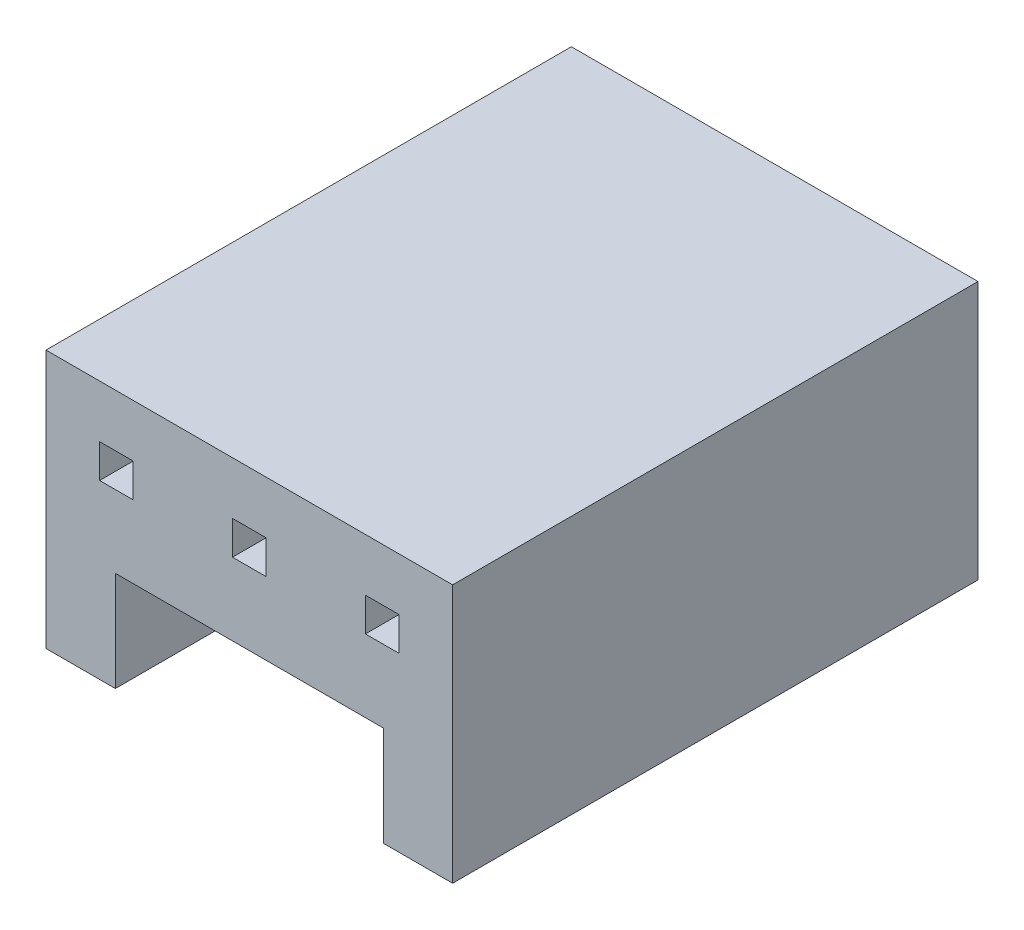
ISO-10303-21;
HEADER;
FILE_DESCRIPTION(('STEP AP214'),'2;1');
FILE_NAME('part.step','',(''),(''),'','','');
FILE_SCHEMA(('AUTOMOTIVE_DESIGN { 1 0 10303 214 1 1 1 1 }'));
ENDSEC;
DATA;
#1=APPLICATION_CONTEXT('core data for automotive mechanical design processes');
#2=APPLICATION_PROTOCOL_DEFINITION('international standard','automotive_design',2000,#1);
#3=PRODUCT_CONTEXT('',#1,'mechanical');
#4=PRODUCT('Part','Part','',(#3));
#5=PRODUCT_RELATED_PRODUCT_CATEGORY('part','',(#4));
#6=PRODUCT_DEFINITION_FORMATION('','',#4);
#7=PRODUCT_DEFINITION_CONTEXT('part definition',#1,'design');
#8=PRODUCT_DEFINITION('design','',#6,#7);
#9=PRODUCT_DEFINITION_SHAPE('','',#8);
#10=(LENGTH_UNIT() NAMED_UNIT(*) SI_UNIT(.MILLI.,.METRE.));
#11=(NAMED_UNIT(*) PLANE_ANGLE_UNIT() SI_UNIT($,.RADIAN.));
#12=(NAMED_UNIT(*) SI_UNIT($,.STERADIAN.) SOLID_ANGLE_UNIT());
#13=UNCERTAINTY_MEASURE_WITH_UNIT(LENGTH_MEASURE(1.E-05),#10,'distance_accuracy_value','');
#14=(GEOMETRIC_REPRESENTATION_CONTEXT(3) GLOBAL_UNCERTAINTY_ASSIGNED_CONTEXT((#13)) GLOBAL_UNIT_ASSIGNED_CONTEXT((#10,
#11,#12)) REPRESENTATION_CONTEXT('',''));
#15=CARTESIAN_POINT('',(0.,0.,0.));
#16=DIRECTION('',(0.,0.,1.));
#17=DIRECTION('',(1.,0.,0.));
#18=AXIS2_PLACEMENT_3D('',#15,#16,#17);
#19=CARTESIAN_POINT('',(0.,0.,-10.));
#20=DIRECTION('',(0.,0.,-1.));
#21=DIRECTION('',(-1.,0.,0.));
#22=AXIS2_PLACEMENT_3D('',#19,#20,#21);
#23=PLANE('',#22);
#24=DIRECTION('',(0.,1.,0.));
#25=VECTOR('',#24,1.);
#26=CARTESIAN_POINT('',(1.66,3.28,-10.));
#27=LINE('',#26,#25);
#28=CARTESIAN_POINT('',(1.66,3.28,-10.));
#29=VERTEX_POINT('',#28);
#30=CARTESIAN_POINT('',(1.66,3.92,-10.));
#31=VERTEX_POINT('',#30);
#32=EDGE_CURVE('E240',#29,#31,#27,.T.);
#33=ORIENTED_EDGE('',*,*,#32,.T.);
#34=DIRECTION('',(-1.,0.,0.));
#35=VECTOR('',#34,1.);
#36=CARTESIAN_POINT('',(1.02,3.92,-10.));
#37=LINE('',#36,#35);
#38=CARTESIAN_POINT('',(1.02,3.92,-10.));
#39=VERTEX_POINT('',#38);
#40=EDGE_CURVE('E244',#31,#39,#37,.T.);
#41=ORIENTED_EDGE('',*,*,#40,.T.);
#42=DIRECTION('',(0.,-1.,0.));
#43=VECTOR('',#42,1.);
#44=CARTESIAN_POINT('',(1.02,3.28,-10.));
#45=LINE('',#44,#43);
#46=CARTESIAN_POINT('',(1.02,3.28,-10.));
#47=VERTEX_POINT('',#46);
#48=EDGE_CURVE('E249',#39,#47,#45,.T.);
#49=ORIENTED_EDGE('',*,*,#48,.T.);
#50=DIRECTION('',(1.,0.,0.));
#51=VECTOR('',#50,1.);
#52=CARTESIAN_POINT('',(1.02,3.28,-10.));
#53=LINE('',#52,#51);
#54=EDGE_CURVE('E253',#47,#29,#53,.T.);
#55=ORIENTED_EDGE('',*,*,#54,.T.);
#56=EDGE_LOOP('',(#33,#41,#49,#55));
#57=FACE_BOUND('',#56,.T.);
#58=DIRECTION('',(0.,1.,0.));
#59=VECTOR('',#58,1.);
#60=CARTESIAN_POINT('',(6.42,0.,-10.));
#61=LINE('',#60,#59);
#62=CARTESIAN_POINT('',(6.42,0.,-10.));
#63=VERTEX_POINT('',#62);
#64=CARTESIAN_POINT('',(6.42,1.9,-10.));
#65=VERTEX_POINT('',#64);
#66=EDGE_CURVE('E312',#63,#65,#61,.T.);
#67=ORIENTED_EDGE('',*,*,#66,.T.);
#68=DIRECTION('',(-1.,0.,0.));
#69=VECTOR('',#68,1.);
#70=CARTESIAN_POINT('',(1.32,1.9,-10.));
#71=LINE('',#70,#69);
#72=CARTESIAN_POINT('',(1.32,1.9,-10.));
#73=VERTEX_POINT('',#72);
#74=EDGE_CURVE('E316',#65,#73,#71,.T.);
#75=ORIENTED_EDGE('',*,*,#74,.T.);
#76=DIRECTION('',(0.,-1.,0.));
#77=VECTOR('',#76,1.);
#78=CARTESIAN_POINT('',(1.32,0.,-10.));
#79=LINE('',#78,#77);
#80=CARTESIAN_POINT('',(1.32,0.,-10.));
#81=VERTEX_POINT('',#80);
#82=EDGE_CURVE('E321',#73,#81,#79,.T.);
#83=ORIENTED_EDGE('',*,*,#82,.T.);
#84=DIRECTION('',(1.,0.,0.));
#85=VECTOR('',#84,1.);
#86=CARTESIAN_POINT('',(0.,0.,-10.));
#87=LINE('',#86,#85);
#88=CARTESIAN_POINT('',(0.,0.,-10.));
#89=VERTEX_POINT('',#88);
#90=EDGE_CURVE('E354',#89,#81,#87,.T.);
#91=ORIENTED_EDGE('',*,*,#90,.F.);
#92=DIRECTION('',(0.,-1.,0.));
#93=VECTOR('',#92,1.);
#94=CARTESIAN_POINT('',(0.,0.,-10.));
#95=LINE('',#94,#93);
#96=CARTESIAN_POINT('',(0.,4.92,-10.));
#97=VERTEX_POINT('',#96);
#98=EDGE_CURVE('E348',#97,#89,#95,.T.);
#99=ORIENTED_EDGE('',*,*,#98,.F.);
#100=DIRECTION('',(-1.,0.,0.));
#101=VECTOR('',#100,1.);
#102=CARTESIAN_POINT('',(0.,4.92,-10.));
#103=LINE('',#102,#101);
#104=CARTESIAN_POINT('',(7.74,4.92,-10.));
#105=VERTEX_POINT('',#104);
#106=EDGE_CURVE('E362',#105,#97,#103,.T.);
#107=ORIENTED_EDGE('',*,*,#106,.F.);
#108=DIRECTION('',(0.,1.,0.));
#109=VECTOR('',#108,1.);
#110=CARTESIAN_POINT('',(7.74,0.,-10.));
#111=LINE('',#110,#109);
#112=CARTESIAN_POINT('',(7.74,0.,-10.));
#113=VERTEX_POINT('',#112);
#114=EDGE_CURVE('E358',#113,#105,#111,.T.);
#115=ORIENTED_EDGE('',*,*,#114,.F.);
#116=EDGE_CURVE('E352',#63,#113,#87,.T.);
#117=ORIENTED_EDGE('',*,*,#116,.F.);
#118=EDGE_LOOP('',(#67,#75,#83,#91,#99,#107,#115,#117));
#119=FACE_BOUND('',#118,.T.);
#120=DIRECTION('',(0.,-1.,0.));
#121=VECTOR('',#120,1.);
#122=CARTESIAN_POINT('',(4.19,3.28,-10.));
#123=LINE('',#122,#121);
#124=CARTESIAN_POINT('',(4.19,3.92,-10.));
#125=VERTEX_POINT('',#124);
#126=CARTESIAN_POINT('',(4.19,3.28,-10.));
#127=VERTEX_POINT('',#126);
#128=EDGE_CURVE('E225',#125,#127,#123,.T.);
#129=ORIENTED_EDGE('',*,*,#128,.F.);
#130=DIRECTION('',(-1.,0.,0.));
#131=VECTOR('',#130,1.);
#132=CARTESIAN_POINT('',(3.55,3.92,-10.));
#133=LINE('',#132,#131);
#134=CARTESIAN_POINT('',(3.55,3.92,-10.));
#135=VERTEX_POINT('',#134);
#136=EDGE_CURVE('E286',#125,#135,#133,.T.);
#137=ORIENTED_EDGE('',*,*,#136,.T.);
#138=DIRECTION('',(0.,-1.,0.));
#139=VECTOR('',#138,1.);
#140=CARTESIAN_POINT('',(3.55,3.28,-10.));
#141=LINE('',#140,#139);
#142=CARTESIAN_POINT('',(3.55,3.28,-10.));
#143=VERTEX_POINT('',#142);
#144=EDGE_CURVE('E290',#135,#143,#141,.T.);
#145=ORIENTED_EDGE('',*,*,#144,.T.);
#146=DIRECTION('',(1.,0.,0.));
#147=VECTOR('',#146,1.);
#148=CARTESIAN_POINT('',(3.55,3.28,-10.));
#149=LINE('',#148,#147);
#150=EDGE_CURVE('E295',#143,#127,#149,.T.);
#151=ORIENTED_EDGE('',*,*,#150,.T.);
#152=EDGE_LOOP('',(#129,#137,#145,#151));
#153=FACE_BOUND('',#152,.T.);
#154=DIRECTION('',(1.,0.,0.));
#155=VECTOR('',#154,1.);
#156=CARTESIAN_POINT('',(6.72,3.92,-10.));
#157=LINE('',#156,#155);
#158=CARTESIAN_POINT('',(6.08,3.92,-10.));
#159=VERTEX_POINT('',#158);
#160=CARTESIAN_POINT('',(6.72,3.92,-10.));
#161=VERTEX_POINT('',#160);
#162=EDGE_CURVE('E192',#159,#161,#157,.T.);
#163=ORIENTED_EDGE('',*,*,#162,.F.);
#164=DIRECTION('',(0.,1.,0.));
#165=VECTOR('',#164,1.);
#166=CARTESIAN_POINT('',(6.08,3.28,-10.));
#167=LINE('',#166,#165);
#168=CARTESIAN_POINT('',(6.08,3.28,-10.));
#169=VERTEX_POINT('',#168);
#170=EDGE_CURVE('E187',#169,#159,#167,.T.);
#171=ORIENTED_EDGE('',*,*,#170,.F.);
#172=DIRECTION('',(-1.,0.,0.));
#173=VECTOR('',#172,1.);
#174=CARTESIAN_POINT('',(6.72,3.28,-10.));
#175=LINE('',#174,#173);
#176=CARTESIAN_POINT('',(6.72,3.28,-10.));
#177=VERTEX_POINT('',#176);
#178=EDGE_CURVE('E178',#177,#169,#175,.T.);
#179=ORIENTED_EDGE('',*,*,#178,.F.);
#180=DIRECTION('',(0.,-1.,0.));
#181=VECTOR('',#180,1.);
#182=CARTESIAN_POINT('',(6.72,3.28,-10.));
#183=LINE('',#182,#181);
#184=EDGE_CURVE('E186',#161,#177,#183,.T.);
#185=ORIENTED_EDGE('',*,*,#184,.F.);
#186=EDGE_LOOP('',(#163,#171,#179,#185));
#187=FACE_BOUND('',#186,.T.);
#188=ADVANCED_FACE('F39',(#57,#119,#153,#187),#23,.T.);
#189=CARTESIAN_POINT('',(0.,0.,0.));
#190=DIRECTION('',(0.,0.,-1.));
#191=DIRECTION('',(-1.,0.,0.));
#192=AXIS2_PLACEMENT_3D('',#189,#190,#191);
#193=PLANE('',#192);
#194=DIRECTION('',(-1.,0.,0.));
#195=VECTOR('',#194,1.);
#196=CARTESIAN_POINT('',(3.55,3.92,0.));
#197=LINE('',#196,#195);
#198=CARTESIAN_POINT('',(4.19,3.92,0.));
#199=VERTEX_POINT('',#198);
#200=CARTESIAN_POINT('',(3.55,3.92,0.));
#201=VERTEX_POINT('',#200);
#202=EDGE_CURVE('E219',#199,#201,#197,.T.);
#203=ORIENTED_EDGE('',*,*,#202,.F.);
#204=DIRECTION('',(0.,-1.,0.));
#205=VECTOR('',#204,1.);
#206=CARTESIAN_POINT('',(4.19,3.28,0.));
#207=LINE('',#206,#205);
#208=CARTESIAN_POINT('',(4.19,3.28,0.));
#209=VERTEX_POINT('',#208);
#210=EDGE_CURVE('E230',#199,#209,#207,.T.);
#211=ORIENTED_EDGE('',*,*,#210,.T.);
#212=DIRECTION('',(1.,0.,0.));
#213=VECTOR('',#212,1.);
#214=CARTESIAN_POINT('',(3.55,3.28,0.));
#215=LINE('',#214,#213);
#216=CARTESIAN_POINT('',(3.55,3.28,0.));
#217=VERTEX_POINT('',#216);
#218=EDGE_CURVE('E291',#217,#209,#215,.T.);
#219=ORIENTED_EDGE('',*,*,#218,.F.);
#220=DIRECTION('',(0.,-1.,0.));
#221=VECTOR('',#220,1.);
#222=CARTESIAN_POINT('',(3.55,3.28,0.));
#223=LINE('',#222,#221);
#224=EDGE_CURVE('E301',#201,#217,#223,.T.);
#225=ORIENTED_EDGE('',*,*,#224,.F.);
#226=EDGE_LOOP('',(#203,#211,#219,#225));
#227=FACE_BOUND('',#226,.T.);
#228=DIRECTION('',(-1.,0.,0.));
#229=VECTOR('',#228,1.);
#230=CARTESIAN_POINT('',(1.02,3.92,0.));
#231=LINE('',#230,#229);
#232=CARTESIAN_POINT('',(1.66,3.92,0.));
#233=VERTEX_POINT('',#232);
#234=CARTESIAN_POINT('',(1.02,3.92,0.));
#235=VERTEX_POINT('',#234);
#236=EDGE_CURVE('E261',#233,#235,#231,.T.);
#237=ORIENTED_EDGE('',*,*,#236,.F.);
#238=DIRECTION('',(0.,1.,0.));
#239=VECTOR('',#238,1.);
#240=CARTESIAN_POINT('',(1.66,3.28,0.));
#241=LINE('',#240,#239);
#242=CARTESIAN_POINT('',(1.66,3.28,0.));
#243=VERTEX_POINT('',#242);
#244=EDGE_CURVE('E258',#243,#233,#241,.T.);
#245=ORIENTED_EDGE('',*,*,#244,.F.);
#246=DIRECTION('',(1.,0.,0.));
#247=VECTOR('',#246,1.);
#248=CARTESIAN_POINT('',(1.02,3.28,0.));
#249=LINE('',#248,#247);
#250=CARTESIAN_POINT('',(1.02,3.28,0.));
#251=VERTEX_POINT('',#250);
#252=EDGE_CURVE('E245',#251,#243,#249,.T.);
#253=ORIENTED_EDGE('',*,*,#252,.F.);
#254=DIRECTION('',(0.,-1.,0.));
#255=VECTOR('',#254,1.);
#256=CARTESIAN_POINT('',(1.02,3.28,0.));
#257=LINE('',#256,#255);
#258=EDGE_CURVE('E266',#235,#251,#257,.T.);
#259=ORIENTED_EDGE('',*,*,#258,.F.);
#260=EDGE_LOOP('',(#237,#245,#253,#259));
#261=FACE_BOUND('',#260,.T.);
#262=DIRECTION('',(-1.,0.,0.));
#263=VECTOR('',#262,1.);
#264=CARTESIAN_POINT('',(1.32,1.9,0.));
#265=LINE('',#264,#263);
#266=CARTESIAN_POINT('',(6.42,1.9,0.));
#267=VERTEX_POINT('',#266);
#268=CARTESIAN_POINT('',(1.32,1.9,0.));
#269=VERTEX_POINT('',#268);
#270=EDGE_CURVE('E328',#267,#269,#265,.T.);
#271=ORIENTED_EDGE('',*,*,#270,.F.);
#272=DIRECTION('',(0.,1.,0.));
#273=VECTOR('',#272,1.);
#274=CARTESIAN_POINT('',(6.42,0.,0.));
#275=LINE('',#274,#273);
#276=CARTESIAN_POINT('',(6.42,0.,0.));
#277=VERTEX_POINT('',#276);
#278=EDGE_CURVE('E276',#277,#267,#275,.T.);
#279=ORIENTED_EDGE('',*,*,#278,.F.);
#280=DIRECTION('',(1.,0.,0.));
#281=VECTOR('',#280,1.);
#282=CARTESIAN_POINT('',(0.,0.,0.));
#283=LINE('',#282,#281);
#284=CARTESIAN_POINT('',(7.74,0.,0.));
#285=VERTEX_POINT('',#284);
#286=EDGE_CURVE('E369',#277,#285,#283,.T.);
#287=ORIENTED_EDGE('',*,*,#286,.T.);
#288=DIRECTION('',(0.,1.,0.));
#289=VECTOR('',#288,1.);
#290=CARTESIAN_POINT('',(7.74,0.,0.));
#291=LINE('',#290,#289);
#292=CARTESIAN_POINT('',(7.74,4.92,0.));
#293=VERTEX_POINT('',#292);
#294=EDGE_CURVE('E374',#285,#293,#291,.T.);
#295=ORIENTED_EDGE('',*,*,#294,.T.);
#296=DIRECTION('',(-1.,0.,0.));
#297=VECTOR('',#296,1.);
#298=CARTESIAN_POINT('',(0.,4.92,0.));
#299=LINE('',#298,#297);
#300=CARTESIAN_POINT('',(0.,4.92,0.));
#301=VERTEX_POINT('',#300);
#302=EDGE_CURVE('E353',#293,#301,#299,.T.);
#303=ORIENTED_EDGE('',*,*,#302,.T.);
#304=DIRECTION('',(0.,-1.,0.));
#305=VECTOR('',#304,1.);
#306=CARTESIAN_POINT('',(0.,0.,0.));
#307=LINE('',#306,#305);
#308=CARTESIAN_POINT('',(0.,0.,0.));
#309=VERTEX_POINT('',#308);
#310=EDGE_CURVE('E337',#301,#309,#307,.T.);
#311=ORIENTED_EDGE('',*,*,#310,.T.);
#312=CARTESIAN_POINT('',(1.32,0.,0.));
#313=VERTEX_POINT('',#312);
#314=EDGE_CURVE('E370',#309,#313,#283,.T.);
#315=ORIENTED_EDGE('',*,*,#314,.T.);
#316=DIRECTION('',(0.,-1.,0.));
#317=VECTOR('',#316,1.);
#318=CARTESIAN_POINT('',(1.32,0.,0.));
#319=LINE('',#318,#317);
#320=EDGE_CURVE('E317',#269,#313,#319,.T.);
#321=ORIENTED_EDGE('',*,*,#320,.F.);
#322=EDGE_LOOP('',(#271,#279,#287,#295,#303,#311,#315,#321));
#323=FACE_BOUND('',#322,.T.);
#324=DIRECTION('',(0.,1.,0.));
#325=VECTOR('',#324,1.);
#326=CARTESIAN_POINT('',(6.08,3.28,0.));
#327=LINE('',#326,#325);
#328=CARTESIAN_POINT('',(6.08,3.28,0.));
#329=VERTEX_POINT('',#328);
#330=CARTESIAN_POINT('',(6.08,3.92,0.));
#331=VERTEX_POINT('',#330);
#332=EDGE_CURVE('E65',#329,#331,#327,.T.);
#333=ORIENTED_EDGE('',*,*,#332,.T.);
#334=DIRECTION('',(1.,0.,0.));
#335=VECTOR('',#334,1.);
#336=CARTESIAN_POINT('',(6.72,3.92,0.));
#337=LINE('',#336,#335);
#338=CARTESIAN_POINT('',(6.72,3.92,0.));
#339=VERTEX_POINT('',#338);
#340=EDGE_CURVE('E196',#331,#339,#337,.T.);
#341=ORIENTED_EDGE('',*,*,#340,.T.);
#342=DIRECTION('',(0.,-1.,0.));
#343=VECTOR('',#342,1.);
#344=CARTESIAN_POINT('',(6.72,3.28,0.));
#345=LINE('',#344,#343);
#346=CARTESIAN_POINT('',(6.72,3.28,0.));
#347=VERTEX_POINT('',#346);
#348=EDGE_CURVE('E200',#339,#347,#345,.T.);
#349=ORIENTED_EDGE('',*,*,#348,.T.);
#350=DIRECTION('',(-1.,0.,0.));
#351=VECTOR('',#350,1.);
#352=CARTESIAN_POINT('',(6.72,3.28,0.));
#353=LINE('',#352,#351);
#354=EDGE_CURVE('E209',#347,#329,#353,.T.);
#355=ORIENTED_EDGE('',*,*,#354,.T.);
#356=EDGE_LOOP('',(#333,#341,#349,#355));
#357=FACE_BOUND('',#356,.T.);
#358=ADVANCED_FACE('F400',(#227,#261,#323,#357),#193,.F.);
#359=CARTESIAN_POINT('',(0.,0.,-10.));
#360=DIRECTION('',(0.,-1.,0.));
#361=DIRECTION('',(0.,0.,-1.));
#362=AXIS2_PLACEMENT_3D('',#359,#360,#361);
#363=PLANE('',#362);
#364=DIRECTION('',(0.,0.,1.));
#365=VECTOR('',#364,1.);
#366=CARTESIAN_POINT('',(6.42,0.,-10.));
#367=LINE('',#366,#365);
#368=EDGE_CURVE('E334',#63,#277,#367,.T.);
#369=ORIENTED_EDGE('',*,*,#368,.F.);
#370=ORIENTED_EDGE('',*,*,#116,.T.);
#371=DIRECTION('',(0.,0.,1.));
#372=VECTOR('',#371,1.);
#373=CARTESIAN_POINT('',(7.74,0.,-10.));
#374=LINE('',#373,#372);
#375=EDGE_CURVE('E382',#113,#285,#374,.T.);
#376=ORIENTED_EDGE('',*,*,#375,.T.);
#377=ORIENTED_EDGE('',*,*,#286,.F.);
#378=EDGE_LOOP('',(#369,#370,#376,#377));
#379=FACE_BOUND('',#378,.T.);
#380=ADVANCED_FACE('F420',(#379),#363,.T.);
#381=CARTESIAN_POINT('',(0.,0.,-10.));
#382=DIRECTION('',(-1.,0.,0.));
#383=DIRECTION('',(0.,0.,1.));
#384=AXIS2_PLACEMENT_3D('',#381,#382,#383);
#385=PLANE('',#384);
#386=ORIENTED_EDGE('',*,*,#310,.F.);
#387=DIRECTION('',(0.,0.,1.));
#388=VECTOR('',#387,1.);
#389=CARTESIAN_POINT('',(0.,4.92,-10.));
#390=LINE('',#389,#388);
#391=EDGE_CURVE('E11',#97,#301,#390,.T.);
#392=ORIENTED_EDGE('',*,*,#391,.F.);
#393=ORIENTED_EDGE('',*,*,#98,.T.);
#394=DIRECTION('',(0.,0.,1.));
#395=VECTOR('',#394,1.);
#396=CARTESIAN_POINT('',(0.,0.,-10.));
#397=LINE('',#396,#395);
#398=EDGE_CURVE('E43',#89,#309,#397,.T.);
#399=ORIENTED_EDGE('',*,*,#398,.T.);
#400=EDGE_LOOP('',(#386,#392,#393,#399));
#401=FACE_BOUND('',#400,.T.);
#402=ADVANCED_FACE('F41',(#401),#385,.T.);
#403=CARTESIAN_POINT('',(0.,4.92,-10.));
#404=DIRECTION('',(0.,1.,0.));
#405=DIRECTION('',(0.,0.,1.));
#406=AXIS2_PLACEMENT_3D('',#403,#404,#405);
#407=PLANE('',#406);
#408=ORIENTED_EDGE('',*,*,#302,.F.);
#409=DIRECTION('',(0.,0.,1.));
#410=VECTOR('',#409,1.);
#411=CARTESIAN_POINT('',(7.74,4.92,-10.));
#412=LINE('',#411,#410);
#413=EDGE_CURVE('E49',#105,#293,#412,.T.);
#414=ORIENTED_EDGE('',*,*,#413,.F.);
#415=ORIENTED_EDGE('',*,*,#106,.T.);
#416=ORIENTED_EDGE('',*,*,#391,.T.);
#417=EDGE_LOOP('',(#408,#414,#415,#416));
#418=FACE_BOUND('',#417,.T.);
#419=ADVANCED_FACE('F404',(#418),#407,.T.);
#420=CARTESIAN_POINT('',(7.74,0.,-10.));
#421=DIRECTION('',(1.,0.,0.));
#422=DIRECTION('',(0.,0.,-1.));
#423=AXIS2_PLACEMENT_3D('',#420,#421,#422);
#424=PLANE('',#423);
#425=ORIENTED_EDGE('',*,*,#294,.F.);
#426=ORIENTED_EDGE('',*,*,#375,.F.);
#427=ORIENTED_EDGE('',*,*,#114,.T.);
#428=ORIENTED_EDGE('',*,*,#413,.T.);
#429=EDGE_LOOP('',(#425,#426,#427,#428));
#430=FACE_BOUND('',#429,.T.);
#431=ADVANCED_FACE('F424',(#430),#424,.T.);
#432=DIRECTION('',(0.,0.,1.));
#433=VECTOR('',#432,1.);
#434=CARTESIAN_POINT('',(1.32,0.,-10.));
#435=LINE('',#434,#433);
#436=EDGE_CURVE('E338',#81,#313,#435,.T.);
#437=ORIENTED_EDGE('',*,*,#436,.T.);
#438=ORIENTED_EDGE('',*,*,#314,.F.);
#439=ORIENTED_EDGE('',*,*,#398,.F.);
#440=ORIENTED_EDGE('',*,*,#90,.T.);
#441=EDGE_LOOP('',(#437,#438,#439,#440));
#442=FACE_BOUND('',#441,.T.);
#443=ADVANCED_FACE('F396',(#442),#363,.T.);
#444=CARTESIAN_POINT('',(6.42,0.,-10.));
#445=DIRECTION('',(1.,0.,0.));
#446=DIRECTION('',(0.,0.,-1.));
#447=AXIS2_PLACEMENT_3D('',#444,#445,#446);
#448=PLANE('',#447);
#449=ORIENTED_EDGE('',*,*,#278,.T.);
#450=DIRECTION('',(0.,0.,1.));
#451=VECTOR('',#450,1.);
#452=CARTESIAN_POINT('',(6.42,1.9,-10.));
#453=LINE('',#452,#451);
#454=EDGE_CURVE('E325',#65,#267,#453,.T.);
#455=ORIENTED_EDGE('',*,*,#454,.F.);
#456=ORIENTED_EDGE('',*,*,#66,.F.);
#457=ORIENTED_EDGE('',*,*,#368,.T.);
#458=EDGE_LOOP('',(#449,#455,#456,#457));
#459=FACE_BOUND('',#458,.T.);
#460=ADVANCED_FACE('F417',(#459),#448,.F.);
#461=CARTESIAN_POINT('',(1.32,0.,-10.));
#462=DIRECTION('',(-1.,0.,0.));
#463=DIRECTION('',(0.,-1.,0.));
#464=AXIS2_PLACEMENT_3D('',#461,#462,#463);
#465=PLANE('',#464);
#466=ORIENTED_EDGE('',*,*,#320,.T.);
#467=ORIENTED_EDGE('',*,*,#436,.F.);
#468=ORIENTED_EDGE('',*,*,#82,.F.);
#469=DIRECTION('',(0.,0.,1.));
#470=VECTOR('',#469,1.);
#471=CARTESIAN_POINT('',(1.32,1.9,-10.));
#472=LINE('',#471,#470);
#473=EDGE_CURVE('E342',#73,#269,#472,.T.);
#474=ORIENTED_EDGE('',*,*,#473,.T.);
#475=EDGE_LOOP('',(#466,#467,#468,#474));
#476=FACE_BOUND('',#475,.T.);
#477=ADVANCED_FACE('F412',(#476),#465,.F.);
#478=CARTESIAN_POINT('',(1.32,1.9,-10.));
#479=DIRECTION('',(0.,1.,0.));
#480=DIRECTION('',(0.,0.,1.));
#481=AXIS2_PLACEMENT_3D('',#478,#479,#480);
#482=PLANE('',#481);
#483=ORIENTED_EDGE('',*,*,#270,.T.);
#484=ORIENTED_EDGE('',*,*,#473,.F.);
#485=ORIENTED_EDGE('',*,*,#74,.F.);
#486=ORIENTED_EDGE('',*,*,#454,.T.);
#487=EDGE_LOOP('',(#483,#484,#485,#486));
#488=FACE_BOUND('',#487,.T.);
#489=ADVANCED_FACE('F415',(#488),#482,.F.);
#490=CARTESIAN_POINT('',(3.55,3.92,-10.));
#491=DIRECTION('',(0.,1.,0.));
#492=DIRECTION('',(0.,0.,1.));
#493=AXIS2_PLACEMENT_3D('',#490,#491,#492);
#494=PLANE('',#493);
#495=ORIENTED_EDGE('',*,*,#202,.T.);
#496=DIRECTION('',(0.,0.,1.));
#497=VECTOR('',#496,1.);
#498=CARTESIAN_POINT('',(3.55,3.92,-10.));
#499=LINE('',#498,#497);
#500=EDGE_CURVE('E298',#135,#201,#499,.T.);
#501=ORIENTED_EDGE('',*,*,#500,.F.);
#502=ORIENTED_EDGE('',*,*,#136,.F.);
#503=DIRECTION('',(0.,0.,1.));
#504=VECTOR('',#503,1.);
#505=CARTESIAN_POINT('',(4.19,3.92,-10.));
#506=LINE('',#505,#504);
#507=EDGE_CURVE('E210',#125,#199,#506,.T.);
#508=ORIENTED_EDGE('',*,*,#507,.T.);
#509=EDGE_LOOP('',(#495,#501,#502,#508));
#510=FACE_BOUND('',#509,.T.);
#511=ADVANCED_FACE('F445',(#510),#494,.F.);
#512=CARTESIAN_POINT('',(3.55,3.28,-10.));
#513=DIRECTION('',(0.,-1.,0.));
#514=DIRECTION('',(0.,0.,-1.));
#515=AXIS2_PLACEMENT_3D('',#512,#513,#514);
#516=PLANE('',#515);
#517=ORIENTED_EDGE('',*,*,#218,.T.);
#518=DIRECTION('',(0.,0.,1.));
#519=VECTOR('',#518,1.);
#520=CARTESIAN_POINT('',(4.19,3.28,-10.));
#521=LINE('',#520,#519);
#522=EDGE_CURVE('E229',#127,#209,#521,.T.);
#523=ORIENTED_EDGE('',*,*,#522,.F.);
#524=ORIENTED_EDGE('',*,*,#150,.F.);
#525=DIRECTION('',(0.,0.,1.));
#526=VECTOR('',#525,1.);
#527=CARTESIAN_POINT('',(3.55,3.28,-10.));
#528=LINE('',#527,#526);
#529=EDGE_CURVE('E262',#143,#217,#528,.T.);
#530=ORIENTED_EDGE('',*,*,#529,.T.);
#531=EDGE_LOOP('',(#517,#523,#524,#530));
#532=FACE_BOUND('',#531,.T.);
#533=ADVANCED_FACE('F450',(#532),#516,.F.);
#534=CARTESIAN_POINT('',(3.55,3.28,-10.));
#535=DIRECTION('',(-1.,0.,0.));
#536=DIRECTION('',(0.,0.,1.));
#537=AXIS2_PLACEMENT_3D('',#534,#535,#536);
#538=PLANE('',#537);
#539=ORIENTED_EDGE('',*,*,#224,.T.);
#540=ORIENTED_EDGE('',*,*,#529,.F.);
#541=ORIENTED_EDGE('',*,*,#144,.F.);
#542=ORIENTED_EDGE('',*,*,#500,.T.);
#543=EDGE_LOOP('',(#539,#540,#541,#542));
#544=FACE_BOUND('',#543,.T.);
#545=ADVANCED_FACE('F452',(#544),#538,.F.);
#546=CARTESIAN_POINT('',(1.66,3.28,-10.));
#547=DIRECTION('',(1.,0.,0.));
#548=DIRECTION('',(0.,0.,-1.));
#549=AXIS2_PLACEMENT_3D('',#546,#547,#548);
#550=PLANE('',#549);
#551=ORIENTED_EDGE('',*,*,#244,.T.);
#552=DIRECTION('',(0.,0.,1.));
#553=VECTOR('',#552,1.);
#554=CARTESIAN_POINT('',(1.66,3.92,-10.));
#555=LINE('',#554,#553);
#556=EDGE_CURVE('E257',#31,#233,#555,.T.);
#557=ORIENTED_EDGE('',*,*,#556,.F.);
#558=ORIENTED_EDGE('',*,*,#32,.F.);
#559=DIRECTION('',(0.,0.,1.));
#560=VECTOR('',#559,1.);
#561=CARTESIAN_POINT('',(1.66,3.28,-10.));
#562=LINE('',#561,#560);
#563=EDGE_CURVE('E273',#29,#243,#562,.T.);
#564=ORIENTED_EDGE('',*,*,#563,.T.);
#565=EDGE_LOOP('',(#551,#557,#558,#564));
#566=FACE_BOUND('',#565,.T.);
#567=ADVANCED_FACE('F455',(#566),#550,.F.);
#568=CARTESIAN_POINT('',(1.02,3.28,-10.));
#569=DIRECTION('',(0.,-1.,0.));
#570=DIRECTION('',(0.,0.,-1.));
#571=AXIS2_PLACEMENT_3D('',#568,#569,#570);
#572=PLANE('',#571);
#573=ORIENTED_EDGE('',*,*,#252,.T.);
#574=ORIENTED_EDGE('',*,*,#563,.F.);
#575=ORIENTED_EDGE('',*,*,#54,.F.);
#576=DIRECTION('',(0.,0.,1.));
#577=VECTOR('',#576,1.);
#578=CARTESIAN_POINT('',(1.02,3.28,-10.));
#579=LINE('',#578,#577);
#580=EDGE_CURVE('E277',#47,#251,#579,.T.);
#581=ORIENTED_EDGE('',*,*,#580,.T.);
#582=EDGE_LOOP('',(#573,#574,#575,#581));
#583=FACE_BOUND('',#582,.T.);
#584=ADVANCED_FACE('F462',(#583),#572,.F.);
#585=CARTESIAN_POINT('',(1.02,3.28,-10.));
#586=DIRECTION('',(-1.,0.,0.));
#587=DIRECTION('',(0.,0.,1.));
#588=AXIS2_PLACEMENT_3D('',#585,#586,#587);
#589=PLANE('',#588);
#590=ORIENTED_EDGE('',*,*,#258,.T.);
#591=ORIENTED_EDGE('',*,*,#580,.F.);
#592=ORIENTED_EDGE('',*,*,#48,.F.);
#593=DIRECTION('',(0.,0.,1.));
#594=VECTOR('',#593,1.);
#595=CARTESIAN_POINT('',(1.02,3.92,-10.));
#596=LINE('',#595,#594);
#597=EDGE_CURVE('E280',#39,#235,#596,.T.);
#598=ORIENTED_EDGE('',*,*,#597,.T.);
#599=EDGE_LOOP('',(#590,#591,#592,#598));
#600=FACE_BOUND('',#599,.T.);
#601=ADVANCED_FACE('F468',(#600),#589,.F.);
#602=CARTESIAN_POINT('',(1.02,3.92,-10.));
#603=DIRECTION('',(0.,1.,0.));
#604=DIRECTION('',(0.,0.,1.));
#605=AXIS2_PLACEMENT_3D('',#602,#603,#604);
#606=PLANE('',#605);
#607=ORIENTED_EDGE('',*,*,#236,.T.);
#608=ORIENTED_EDGE('',*,*,#597,.F.);
#609=ORIENTED_EDGE('',*,*,#40,.F.);
#610=ORIENTED_EDGE('',*,*,#556,.T.);
#611=EDGE_LOOP('',(#607,#608,#609,#610));
#612=FACE_BOUND('',#611,.T.);
#613=ADVANCED_FACE('F464',(#612),#606,.F.);
#614=CARTESIAN_POINT('',(4.19,3.28,-10.));
#615=DIRECTION('',(-1.,0.,0.));
#616=DIRECTION('',(0.,0.,1.));
#617=AXIS2_PLACEMENT_3D('',#614,#615,#616);
#618=PLANE('',#617);
#619=ORIENTED_EDGE('',*,*,#210,.F.);
#620=ORIENTED_EDGE('',*,*,#507,.F.);
#621=ORIENTED_EDGE('',*,*,#128,.T.);
#622=ORIENTED_EDGE('',*,*,#522,.T.);
#623=EDGE_LOOP('',(#619,#620,#621,#622));
#624=FACE_BOUND('',#623,.T.);
#625=ADVANCED_FACE('F467',(#624),#618,.T.);
#626=CARTESIAN_POINT('',(6.08,3.28,-10.));
#627=DIRECTION('',(1.,0.,0.));
#628=DIRECTION('',(0.,0.,-1.));
#629=AXIS2_PLACEMENT_3D('',#626,#627,#628);
#630=PLANE('',#629);
#631=ORIENTED_EDGE('',*,*,#332,.F.);
#632=DIRECTION('',(0.,0.,1.));
#633=VECTOR('',#632,1.);
#634=CARTESIAN_POINT('',(6.08,3.28,-10.));
#635=LINE('',#634,#633);
#636=EDGE_CURVE('E180',#169,#329,#635,.T.);
#637=ORIENTED_EDGE('',*,*,#636,.F.);
#638=ORIENTED_EDGE('',*,*,#170,.T.);
#639=DIRECTION('',(0.,0.,1.));
#640=VECTOR('',#639,1.);
#641=CARTESIAN_POINT('',(6.08,3.92,-10.));
#642=LINE('',#641,#640);
#643=EDGE_CURVE('E216',#159,#331,#642,.T.);
#644=ORIENTED_EDGE('',*,*,#643,.T.);
#645=EDGE_LOOP('',(#631,#637,#638,#644));
#646=FACE_BOUND('',#645,.T.);
#647=ADVANCED_FACE('F189',(#646),#630,.T.);
#648=CARTESIAN_POINT('',(6.72,3.92,-10.));
#649=DIRECTION('',(0.,-1.,0.));
#650=DIRECTION('',(0.,0.,-1.));
#651=AXIS2_PLACEMENT_3D('',#648,#649,#650);
#652=PLANE('',#651);
#653=ORIENTED_EDGE('',*,*,#340,.F.);
#654=ORIENTED_EDGE('',*,*,#643,.F.);
#655=ORIENTED_EDGE('',*,*,#162,.T.);
#656=DIRECTION('',(0.,0.,1.));
#657=VECTOR('',#656,1.);
#658=CARTESIAN_POINT('',(6.72,3.92,-10.));
#659=LINE('',#658,#657);
#660=EDGE_CURVE('E220',#161,#339,#659,.T.);
#661=ORIENTED_EDGE('',*,*,#660,.T.);
#662=EDGE_LOOP('',(#653,#654,#655,#661));
#663=FACE_BOUND('',#662,.T.);
#664=ADVANCED_FACE('F481',(#663),#652,.T.);
#665=CARTESIAN_POINT('',(6.72,3.28,-10.));
#666=DIRECTION('',(-1.,0.,0.));
#667=DIRECTION('',(0.,0.,1.));
#668=AXIS2_PLACEMENT_3D('',#665,#666,#667);
#669=PLANE('',#668);
#670=ORIENTED_EDGE('',*,*,#348,.F.);
#671=ORIENTED_EDGE('',*,*,#660,.F.);
#672=ORIENTED_EDGE('',*,*,#184,.T.);
#673=DIRECTION('',(0.,0.,1.));
#674=VECTOR('',#673,1.);
#675=CARTESIAN_POINT('',(6.72,3.28,-10.));
#676=LINE('',#675,#674);
#677=EDGE_CURVE('E57',#177,#347,#676,.T.);
#678=ORIENTED_EDGE('',*,*,#677,.T.);
#679=EDGE_LOOP('',(#670,#671,#672,#678));
#680=FACE_BOUND('',#679,.T.);
#681=ADVANCED_FACE('F484',(#680),#669,.T.);
#682=CARTESIAN_POINT('',(6.72,3.28,-10.));
#683=DIRECTION('',(0.,1.,0.));
#684=DIRECTION('',(0.,0.,1.));
#685=AXIS2_PLACEMENT_3D('',#682,#683,#684);
#686=PLANE('',#685);
#687=ORIENTED_EDGE('',*,*,#354,.F.);
#688=ORIENTED_EDGE('',*,*,#677,.F.);
#689=ORIENTED_EDGE('',*,*,#178,.T.);
#690=ORIENTED_EDGE('',*,*,#636,.T.);
#691=EDGE_LOOP('',(#687,#688,#689,#690));
#692=FACE_BOUND('',#691,.T.);
#693=ADVANCED_FACE('F179',(#692),#686,.T.);
#694=CLOSED_SHELL('',(#188,#358,#380,#402,#419,#431,#443,#460,#477,#489,#511,#533,#545,#567,
#584,#601,#613,#625,#647,#664,#681,#693));
#695=MANIFOLD_SOLID_BREP('B2',#694);
#696=ADVANCED_BREP_SHAPE_REPRESENTATION('',(#18,#695),#14);
#697=SHAPE_DEFINITION_REPRESENTATION(#9,#696);
ENDSEC;
END-ISO-10303-21;
